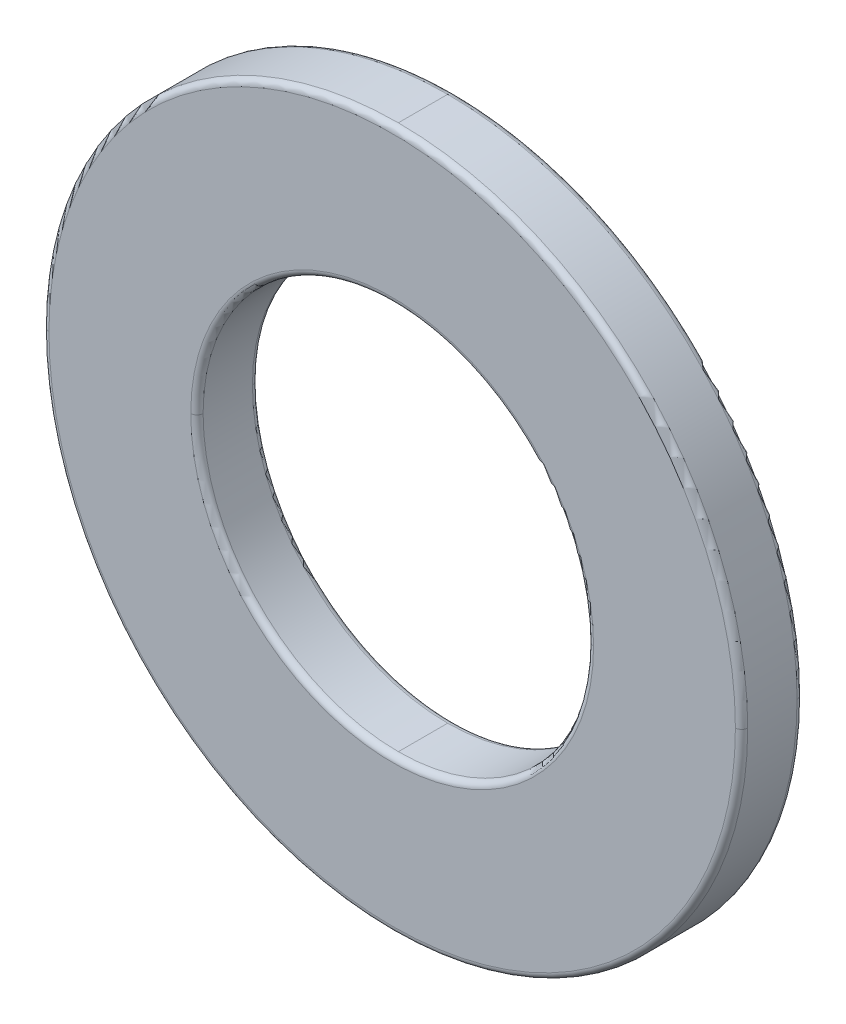
ISO-10303-21;
HEADER;
FILE_DESCRIPTION(('STEP AP214'),'2;1');
FILE_NAME('part.step','',(''),(''),'','','');
FILE_SCHEMA(('AUTOMOTIVE_DESIGN { 1 0 10303 214 1 1 1 1 }'));
ENDSEC;
DATA;
#1=APPLICATION_CONTEXT('core data for automotive mechanical design processes');
#2=APPLICATION_PROTOCOL_DEFINITION('international standard','automotive_design',2000,#1);
#3=PRODUCT_CONTEXT('',#1,'mechanical');
#4=PRODUCT('Part','Part','',(#3));
#5=PRODUCT_RELATED_PRODUCT_CATEGORY('part','',(#4));
#6=PRODUCT_DEFINITION_FORMATION('','',#4);
#7=PRODUCT_DEFINITION_CONTEXT('part definition',#1,'design');
#8=PRODUCT_DEFINITION('design','',#6,#7);
#9=PRODUCT_DEFINITION_SHAPE('','',#8);
#10=(LENGTH_UNIT() NAMED_UNIT(*) SI_UNIT(.MILLI.,.METRE.));
#11=(NAMED_UNIT(*) PLANE_ANGLE_UNIT() SI_UNIT($,.RADIAN.));
#12=(NAMED_UNIT(*) SI_UNIT($,.STERADIAN.) SOLID_ANGLE_UNIT());
#13=UNCERTAINTY_MEASURE_WITH_UNIT(LENGTH_MEASURE(1.E-05),#10,'distance_accuracy_value','');
#14=(GEOMETRIC_REPRESENTATION_CONTEXT(3) GLOBAL_UNCERTAINTY_ASSIGNED_CONTEXT((#13)) GLOBAL_UNIT_ASSIGNED_CONTEXT((#10,
#11,#12)) REPRESENTATION_CONTEXT('',''));
#15=CARTESIAN_POINT('',(0.,0.,0.));
#16=DIRECTION('',(0.,0.,1.));
#17=DIRECTION('',(1.,0.,0.));
#18=AXIS2_PLACEMENT_3D('',#15,#16,#17);
#19=CARTESIAN_POINT('',(0.,0.,128.2));
#20=DIRECTION('',(0.,0.,-1.));
#21=DIRECTION('',(-1.,0.,0.));
#22=AXIS2_PLACEMENT_3D('',#19,#20,#21);
#23=TOROIDAL_SURFACE('',#22,9.8,0.3);
#24=CARTESIAN_POINT('',(-9.8,0.,128.2));
#25=DIRECTION('',(0.,-1.,0.));
#26=DIRECTION('',(-1.,0.,0.));
#27=AXIS2_PLACEMENT_3D('',#24,#25,#26);
#28=CIRCLE('',#27,0.3);
#29=CARTESIAN_POINT('',(-9.5,0.,128.2));
#30=VERTEX_POINT('',#29);
#31=CARTESIAN_POINT('',(-9.8,0.,128.5));
#32=VERTEX_POINT('',#31);
#33=EDGE_CURVE('E11',#30,#32,#28,.T.);
#34=ORIENTED_EDGE('',*,*,#33,.T.);
#35=CARTESIAN_POINT('',(0.,0.,128.5));
#36=DIRECTION('',(0.,0.,1.));
#37=DIRECTION('',(0.,1.,0.));
#38=AXIS2_PLACEMENT_3D('',#35,#36,#37);
#39=CIRCLE('',#38,9.8);
#40=CARTESIAN_POINT('',(9.8,0.,128.5));
#41=VERTEX_POINT('',#40);
#42=EDGE_CURVE('E52',#32,#41,#39,.T.);
#43=ORIENTED_EDGE('',*,*,#42,.T.);
#44=CARTESIAN_POINT('',(9.8,0.,128.2));
#45=DIRECTION('',(0.,-1.,0.));
#46=DIRECTION('',(1.,0.,0.));
#47=AXIS2_PLACEMENT_3D('',#44,#45,#46);
#48=CIRCLE('',#47,0.3);
#49=CARTESIAN_POINT('',(9.5,0.,128.2));
#50=VERTEX_POINT('',#49);
#51=EDGE_CURVE('E207',#41,#50,#48,.T.);
#52=ORIENTED_EDGE('',*,*,#51,.T.);
#53=CARTESIAN_POINT('',(0.,0.,128.2));
#54=DIRECTION('',(0.,0.,-1.));
#55=DIRECTION('',(0.,1.,0.));
#56=AXIS2_PLACEMENT_3D('',#53,#54,#55);
#57=CIRCLE('',#56,9.5);
#58=CARTESIAN_POINT('',(0.,-9.5,128.2));
#59=VERTEX_POINT('',#58);
#60=EDGE_CURVE('E196',#50,#59,#57,.T.);
#61=ORIENTED_EDGE('',*,*,#60,.T.);
#62=CARTESIAN_POINT('',(0.,0.,128.2));
#63=DIRECTION('',(0.,0.,-1.));
#64=DIRECTION('',(0.,1.,0.));
#65=AXIS2_PLACEMENT_3D('',#62,#63,#64);
#66=CIRCLE('',#65,9.5);
#67=EDGE_CURVE('E144',#59,#30,#66,.T.);
#68=ORIENTED_EDGE('',*,*,#67,.T.);
#69=EDGE_LOOP('',(#34,#43,#52,#61,#68));
#70=FACE_BOUND('',#69,.T.);
#71=ADVANCED_FACE('F42',(#70),#23,.T.);
#72=CARTESIAN_POINT('',(0.,0.,125.5));
#73=DIRECTION('',(0.,0.,-1.));
#74=DIRECTION('',(0.,1.,0.));
#75=AXIS2_PLACEMENT_3D('',#72,#73,#74);
#76=CYLINDRICAL_SURFACE('',#75,9.5);
#77=DIRECTION('',(0.,0.,-1.));
#78=VECTOR('',#77,1.);
#79=CARTESIAN_POINT('',(0.,9.5,127.));
#80=LINE('',#79,#78);
#81=CARTESIAN_POINT('',(0.,9.5,128.2));
#82=VERTEX_POINT('',#81);
#83=CARTESIAN_POINT('',(0.,9.5,125.8));
#84=VERTEX_POINT('',#83);
#85=EDGE_CURVE('E163',#82,#84,#80,.T.);
#86=ORIENTED_EDGE('',*,*,#85,.T.);
#87=CARTESIAN_POINT('',(0.,0.,125.8));
#88=DIRECTION('',(0.,0.,1.));
#89=DIRECTION('',(0.,1.,0.));
#90=AXIS2_PLACEMENT_3D('',#87,#88,#89);
#91=CIRCLE('',#90,9.5);
#92=CARTESIAN_POINT('',(9.5,0.,125.8));
#93=VERTEX_POINT('',#92);
#94=EDGE_CURVE('E150',#93,#84,#91,.T.);
#95=ORIENTED_EDGE('',*,*,#94,.F.);
#96=CARTESIAN_POINT('',(0.,0.,125.8));
#97=DIRECTION('',(0.,0.,1.));
#98=DIRECTION('',(0.,1.,0.));
#99=AXIS2_PLACEMENT_3D('',#96,#97,#98);
#100=CIRCLE('',#99,9.5);
#101=CARTESIAN_POINT('',(0.,-9.5,125.8));
#102=VERTEX_POINT('',#101);
#103=EDGE_CURVE('E199',#102,#93,#100,.T.);
#104=ORIENTED_EDGE('',*,*,#103,.F.);
#105=DIRECTION('',(0.,0.,1.));
#106=VECTOR('',#105,1.);
#107=CARTESIAN_POINT('',(0.,-9.5,127.));
#108=LINE('',#107,#106);
#109=EDGE_CURVE('E170',#102,#59,#108,.T.);
#110=ORIENTED_EDGE('',*,*,#109,.T.);
#111=ORIENTED_EDGE('',*,*,#60,.F.);
#112=CARTESIAN_POINT('',(0.,0.,128.2));
#113=DIRECTION('',(0.,0.,-1.));
#114=DIRECTION('',(0.,1.,0.));
#115=AXIS2_PLACEMENT_3D('',#112,#113,#114);
#116=CIRCLE('',#115,9.5);
#117=EDGE_CURVE('E166',#82,#50,#116,.T.);
#118=ORIENTED_EDGE('',*,*,#117,.F.);
#119=EDGE_LOOP('',(#86,#95,#104,#110,#111,#118));
#120=FACE_BOUND('',#119,.T.);
#121=ADVANCED_FACE('F164',(#120),#76,.F.);
#122=CARTESIAN_POINT('',(0.,0.,125.8));
#123=DIRECTION('',(0.,0.,1.));
#124=DIRECTION('',(1.,0.,0.));
#125=AXIS2_PLACEMENT_3D('',#122,#123,#124);
#126=TOROIDAL_SURFACE('',#125,9.8,0.3);
#127=CARTESIAN_POINT('',(9.8,0.,125.8));
#128=DIRECTION('',(0.,-1.,0.));
#129=DIRECTION('',(1.,0.,0.));
#130=AXIS2_PLACEMENT_3D('',#127,#128,#129);
#131=CIRCLE('',#130,0.3);
#132=CARTESIAN_POINT('',(9.8,0.,125.5));
#133=VERTEX_POINT('',#132);
#134=EDGE_CURVE('E157',#93,#133,#131,.T.);
#135=ORIENTED_EDGE('',*,*,#134,.T.);
#136=CARTESIAN_POINT('',(0.,0.,125.5));
#137=DIRECTION('',(0.,0.,-1.));
#138=DIRECTION('',(0.,1.,0.));
#139=AXIS2_PLACEMENT_3D('',#136,#137,#138);
#140=CIRCLE('',#139,9.8);
#141=CARTESIAN_POINT('',(-9.8,0.,125.5));
#142=VERTEX_POINT('',#141);
#143=EDGE_CURVE('E211',#133,#142,#140,.T.);
#144=ORIENTED_EDGE('',*,*,#143,.T.);
#145=CARTESIAN_POINT('',(-9.8,0.,125.8));
#146=DIRECTION('',(0.,-1.,0.));
#147=DIRECTION('',(-1.,0.,0.));
#148=AXIS2_PLACEMENT_3D('',#145,#146,#147);
#149=CIRCLE('',#148,0.3);
#150=CARTESIAN_POINT('',(-9.5,0.,125.8));
#151=VERTEX_POINT('',#150);
#152=EDGE_CURVE('E213',#142,#151,#149,.T.);
#153=ORIENTED_EDGE('',*,*,#152,.T.);
#154=CARTESIAN_POINT('',(0.,0.,125.8));
#155=DIRECTION('',(0.,0.,1.));
#156=DIRECTION('',(0.,1.,0.));
#157=AXIS2_PLACEMENT_3D('',#154,#155,#156);
#158=CIRCLE('',#157,9.5);
#159=EDGE_CURVE('E175',#151,#102,#158,.T.);
#160=ORIENTED_EDGE('',*,*,#159,.T.);
#161=ORIENTED_EDGE('',*,*,#103,.T.);
#162=EDGE_LOOP('',(#135,#144,#153,#160,#161));
#163=FACE_BOUND('',#162,.T.);
#164=ADVANCED_FACE('F270',(#163),#126,.T.);
#165=CARTESIAN_POINT('',(0.,0.,125.8));
#166=DIRECTION('',(0.,0.,-1.));
#167=DIRECTION('',(-1.,0.,0.));
#168=AXIS2_PLACEMENT_3D('',#165,#166,#167);
#169=TOROIDAL_SURFACE('',#168,16.7,0.3);
#170=CARTESIAN_POINT('',(-16.7,0.,125.8));
#171=DIRECTION('',(0.,-1.,0.));
#172=DIRECTION('',(-1.,0.,0.));
#173=AXIS2_PLACEMENT_3D('',#170,#171,#172);
#174=CIRCLE('',#173,0.3);
#175=CARTESIAN_POINT('',(-17.,0.,125.8));
#176=VERTEX_POINT('',#175);
#177=CARTESIAN_POINT('',(-16.7,0.,125.5));
#178=VERTEX_POINT('',#177);
#179=EDGE_CURVE('E201',#176,#178,#174,.T.);
#180=ORIENTED_EDGE('',*,*,#179,.T.);
#181=CARTESIAN_POINT('',(0.,0.,125.5));
#182=DIRECTION('',(0.,0.,1.));
#183=DIRECTION('',(0.,1.,0.));
#184=AXIS2_PLACEMENT_3D('',#181,#182,#183);
#185=CIRCLE('',#184,16.7);
#186=CARTESIAN_POINT('',(16.7,0.,125.5));
#187=VERTEX_POINT('',#186);
#188=EDGE_CURVE('E240',#178,#187,#185,.T.);
#189=ORIENTED_EDGE('',*,*,#188,.T.);
#190=CARTESIAN_POINT('',(16.7,0.,125.8));
#191=DIRECTION('',(0.,-1.,0.));
#192=DIRECTION('',(1.,0.,0.));
#193=AXIS2_PLACEMENT_3D('',#190,#191,#192);
#194=CIRCLE('',#193,0.3);
#195=CARTESIAN_POINT('',(17.,0.,125.8));
#196=VERTEX_POINT('',#195);
#197=EDGE_CURVE('E95',#187,#196,#194,.T.);
#198=ORIENTED_EDGE('',*,*,#197,.T.);
#199=CARTESIAN_POINT('',(0.,0.,125.8));
#200=DIRECTION('',(0.,0.,-1.));
#201=DIRECTION('',(0.,1.,0.));
#202=AXIS2_PLACEMENT_3D('',#199,#200,#201);
#203=CIRCLE('',#202,17.);
#204=CARTESIAN_POINT('',(0.,-17.,125.8));
#205=VERTEX_POINT('',#204);
#206=EDGE_CURVE('E106',#196,#205,#203,.T.);
#207=ORIENTED_EDGE('',*,*,#206,.T.);
#208=CARTESIAN_POINT('',(0.,0.,125.8));
#209=DIRECTION('',(0.,0.,-1.));
#210=DIRECTION('',(0.,1.,0.));
#211=AXIS2_PLACEMENT_3D('',#208,#209,#210);
#212=CIRCLE('',#211,17.);
#213=EDGE_CURVE('E185',#205,#176,#212,.T.);
#214=ORIENTED_EDGE('',*,*,#213,.T.);
#215=EDGE_LOOP('',(#180,#189,#198,#207,#214));
#216=FACE_BOUND('',#215,.T.);
#217=ADVANCED_FACE('F256',(#216),#169,.T.);
#218=CARTESIAN_POINT('',(0.,0.,125.5));
#219=DIRECTION('',(0.,0.,-1.));
#220=DIRECTION('',(0.,1.,0.));
#221=AXIS2_PLACEMENT_3D('',#218,#219,#220);
#222=CYLINDRICAL_SURFACE('',#221,17.);
#223=DIRECTION('',(0.,0.,1.));
#224=VECTOR('',#223,1.);
#225=CARTESIAN_POINT('',(0.,17.,127.));
#226=LINE('',#225,#224);
#227=CARTESIAN_POINT('',(0.,17.,125.8));
#228=VERTEX_POINT('',#227);
#229=CARTESIAN_POINT('',(0.,17.,128.2));
#230=VERTEX_POINT('',#229);
#231=EDGE_CURVE('E183',#228,#230,#226,.T.);
#232=ORIENTED_EDGE('',*,*,#231,.T.);
#233=CARTESIAN_POINT('',(0.,0.,128.2));
#234=DIRECTION('',(0.,0.,1.));
#235=DIRECTION('',(0.,1.,0.));
#236=AXIS2_PLACEMENT_3D('',#233,#234,#235);
#237=CIRCLE('',#236,17.);
#238=CARTESIAN_POINT('',(17.,0.,128.2));
#239=VERTEX_POINT('',#238);
#240=EDGE_CURVE('E191',#239,#230,#237,.T.);
#241=ORIENTED_EDGE('',*,*,#240,.F.);
#242=CARTESIAN_POINT('',(0.,0.,128.2));
#243=DIRECTION('',(0.,0.,1.));
#244=DIRECTION('',(0.,1.,0.));
#245=AXIS2_PLACEMENT_3D('',#242,#243,#244);
#246=CIRCLE('',#245,17.);
#247=CARTESIAN_POINT('',(0.,-17.,128.2));
#248=VERTEX_POINT('',#247);
#249=EDGE_CURVE('E205',#248,#239,#246,.T.);
#250=ORIENTED_EDGE('',*,*,#249,.F.);
#251=DIRECTION('',(0.,0.,-1.));
#252=VECTOR('',#251,1.);
#253=CARTESIAN_POINT('',(0.,-17.,127.));
#254=LINE('',#253,#252);
#255=EDGE_CURVE('E186',#248,#205,#254,.T.);
#256=ORIENTED_EDGE('',*,*,#255,.T.);
#257=ORIENTED_EDGE('',*,*,#206,.F.);
#258=CARTESIAN_POINT('',(0.,0.,125.8));
#259=DIRECTION('',(0.,0.,-1.));
#260=DIRECTION('',(0.,1.,0.));
#261=AXIS2_PLACEMENT_3D('',#258,#259,#260);
#262=CIRCLE('',#261,17.);
#263=EDGE_CURVE('E197',#228,#196,#262,.T.);
#264=ORIENTED_EDGE('',*,*,#263,.F.);
#265=EDGE_LOOP('',(#232,#241,#250,#256,#257,#264));
#266=FACE_BOUND('',#265,.T.);
#267=ADVANCED_FACE('F224',(#266),#222,.T.);
#268=CARTESIAN_POINT('',(0.,0.,128.2));
#269=DIRECTION('',(0.,0.,-1.));
#270=DIRECTION('',(-1.,0.,0.));
#271=AXIS2_PLACEMENT_3D('',#268,#269,#270);
#272=TOROIDAL_SURFACE('',#271,16.7,0.3);
#273=CARTESIAN_POINT('',(-16.7,0.,128.2));
#274=DIRECTION('',(0.,-1.,0.));
#275=DIRECTION('',(-1.,0.,0.));
#276=AXIS2_PLACEMENT_3D('',#273,#274,#275);
#277=CIRCLE('',#276,0.3);
#278=CARTESIAN_POINT('',(-16.7,0.,128.5));
#279=VERTEX_POINT('',#278);
#280=CARTESIAN_POINT('',(-17.,0.,128.2));
#281=VERTEX_POINT('',#280);
#282=EDGE_CURVE('E46',#279,#281,#277,.T.);
#283=ORIENTED_EDGE('',*,*,#282,.T.);
#284=CARTESIAN_POINT('',(0.,0.,128.2));
#285=DIRECTION('',(0.,0.,1.));
#286=DIRECTION('',(0.,1.,0.));
#287=AXIS2_PLACEMENT_3D('',#284,#285,#286);
#288=CIRCLE('',#287,17.);
#289=EDGE_CURVE('E202',#281,#248,#288,.T.);
#290=ORIENTED_EDGE('',*,*,#289,.T.);
#291=ORIENTED_EDGE('',*,*,#249,.T.);
#292=CARTESIAN_POINT('',(16.7,0.,128.2));
#293=DIRECTION('',(0.,-1.,0.));
#294=DIRECTION('',(1.,0.,0.));
#295=AXIS2_PLACEMENT_3D('',#292,#293,#294);
#296=CIRCLE('',#295,0.3);
#297=CARTESIAN_POINT('',(16.7,0.,128.5));
#298=VERTEX_POINT('',#297);
#299=EDGE_CURVE('E232',#239,#298,#296,.T.);
#300=ORIENTED_EDGE('',*,*,#299,.T.);
#301=CARTESIAN_POINT('',(0.,0.,128.5));
#302=DIRECTION('',(0.,0.,-1.));
#303=DIRECTION('',(0.,1.,0.));
#304=AXIS2_PLACEMENT_3D('',#301,#302,#303);
#305=CIRCLE('',#304,16.7);
#306=CARTESIAN_POINT('',(0.,-16.7,128.5));
#307=VERTEX_POINT('',#306);
#308=EDGE_CURVE('E126',#298,#307,#305,.T.);
#309=ORIENTED_EDGE('',*,*,#308,.T.);
#310=CARTESIAN_POINT('',(0.,0.,128.5));
#311=DIRECTION('',(0.,0.,-1.));
#312=DIRECTION('',(0.,1.,0.));
#313=AXIS2_PLACEMENT_3D('',#310,#311,#312);
#314=CIRCLE('',#313,16.7);
#315=EDGE_CURVE('E123',#307,#279,#314,.T.);
#316=ORIENTED_EDGE('',*,*,#315,.T.);
#317=EDGE_LOOP('',(#283,#290,#291,#300,#309,#316));
#318=FACE_BOUND('',#317,.T.);
#319=ADVANCED_FACE('F257',(#318),#272,.T.);
#320=CARTESIAN_POINT('',(0.,0.,128.2));
#321=DIRECTION('',(0.,0.,-1.));
#322=DIRECTION('',(-1.,0.,0.));
#323=AXIS2_PLACEMENT_3D('',#320,#321,#322);
#324=TOROIDAL_SURFACE('',#323,16.7,0.3);
#325=ORIENTED_EDGE('',*,*,#282,.F.);
#326=CARTESIAN_POINT('',(0.,0.,128.5));
#327=DIRECTION('',(0.,0.,-1.));
#328=DIRECTION('',(0.,1.,0.));
#329=AXIS2_PLACEMENT_3D('',#326,#327,#328);
#330=CIRCLE('',#329,16.7);
#331=EDGE_CURVE('E233',#279,#298,#330,.T.);
#332=ORIENTED_EDGE('',*,*,#331,.T.);
#333=ORIENTED_EDGE('',*,*,#299,.F.);
#334=ORIENTED_EDGE('',*,*,#240,.T.);
#335=CARTESIAN_POINT('',(0.,0.,128.2));
#336=DIRECTION('',(0.,0.,1.));
#337=DIRECTION('',(0.,1.,0.));
#338=AXIS2_PLACEMENT_3D('',#335,#336,#337);
#339=CIRCLE('',#338,17.);
#340=EDGE_CURVE('E188',#230,#281,#339,.T.);
#341=ORIENTED_EDGE('',*,*,#340,.T.);
#342=EDGE_LOOP('',(#325,#332,#333,#334,#341));
#343=FACE_BOUND('',#342,.T.);
#344=ADVANCED_FACE('F230',(#343),#324,.T.);
#345=CARTESIAN_POINT('',(0.,0.,125.5));
#346=DIRECTION('',(0.,0.,-1.));
#347=DIRECTION('',(0.,1.,0.));
#348=AXIS2_PLACEMENT_3D('',#345,#346,#347);
#349=CYLINDRICAL_SURFACE('',#348,17.);
#350=ORIENTED_EDGE('',*,*,#231,.F.);
#351=CARTESIAN_POINT('',(0.,0.,125.8));
#352=DIRECTION('',(0.,0.,-1.));
#353=DIRECTION('',(0.,1.,0.));
#354=AXIS2_PLACEMENT_3D('',#351,#352,#353);
#355=CIRCLE('',#354,17.);
#356=EDGE_CURVE('E192',#176,#228,#355,.T.);
#357=ORIENTED_EDGE('',*,*,#356,.F.);
#358=ORIENTED_EDGE('',*,*,#213,.F.);
#359=ORIENTED_EDGE('',*,*,#255,.F.);
#360=ORIENTED_EDGE('',*,*,#289,.F.);
#361=ORIENTED_EDGE('',*,*,#340,.F.);
#362=EDGE_LOOP('',(#350,#357,#358,#359,#360,#361));
#363=FACE_BOUND('',#362,.T.);
#364=ADVANCED_FACE('F221',(#363),#349,.T.);
#365=CARTESIAN_POINT('',(0.,0.,128.5));
#366=DIRECTION('',(0.,0.,-1.));
#367=DIRECTION('',(-1.,0.,0.));
#368=AXIS2_PLACEMENT_3D('',#365,#366,#367);
#369=PLANE('',#368);
#370=ORIENTED_EDGE('',*,*,#315,.F.);
#371=ORIENTED_EDGE('',*,*,#308,.F.);
#372=ORIENTED_EDGE('',*,*,#331,.F.);
#373=EDGE_LOOP('',(#370,#371,#372));
#374=FACE_BOUND('',#373,.T.);
#375=CARTESIAN_POINT('',(0.,0.,128.5));
#376=DIRECTION('',(0.,0.,1.));
#377=DIRECTION('',(0.,1.,0.));
#378=AXIS2_PLACEMENT_3D('',#375,#376,#377);
#379=CIRCLE('',#378,9.8);
#380=EDGE_CURVE('E238',#41,#32,#379,.T.);
#381=ORIENTED_EDGE('',*,*,#380,.F.);
#382=ORIENTED_EDGE('',*,*,#42,.F.);
#383=EDGE_LOOP('',(#381,#382));
#384=FACE_BOUND('',#383,.T.);
#385=ADVANCED_FACE('F260',(#374,#384),#369,.F.);
#386=CARTESIAN_POINT('',(0.,0.,125.8));
#387=DIRECTION('',(0.,0.,-1.));
#388=DIRECTION('',(-1.,0.,0.));
#389=AXIS2_PLACEMENT_3D('',#386,#387,#388);
#390=TOROIDAL_SURFACE('',#389,16.7,0.3);
#391=ORIENTED_EDGE('',*,*,#179,.F.);
#392=ORIENTED_EDGE('',*,*,#356,.T.);
#393=ORIENTED_EDGE('',*,*,#263,.T.);
#394=ORIENTED_EDGE('',*,*,#197,.F.);
#395=CARTESIAN_POINT('',(0.,0.,125.5));
#396=DIRECTION('',(0.,0.,1.));
#397=DIRECTION('',(0.,1.,0.));
#398=AXIS2_PLACEMENT_3D('',#395,#396,#397);
#399=CIRCLE('',#398,16.7);
#400=EDGE_CURVE('E160',#187,#178,#399,.T.);
#401=ORIENTED_EDGE('',*,*,#400,.T.);
#402=EDGE_LOOP('',(#391,#392,#393,#394,#401));
#403=FACE_BOUND('',#402,.T.);
#404=ADVANCED_FACE('F217',(#403),#390,.T.);
#405=CARTESIAN_POINT('',(0.,0.,125.5));
#406=DIRECTION('',(0.,0.,-1.));
#407=DIRECTION('',(-1.,0.,0.));
#408=AXIS2_PLACEMENT_3D('',#405,#406,#407);
#409=PLANE('',#408);
#410=ORIENTED_EDGE('',*,*,#400,.F.);
#411=ORIENTED_EDGE('',*,*,#188,.F.);
#412=EDGE_LOOP('',(#410,#411));
#413=FACE_BOUND('',#412,.T.);
#414=CARTESIAN_POINT('',(0.,0.,125.5));
#415=DIRECTION('',(0.,0.,-1.));
#416=DIRECTION('',(0.,1.,0.));
#417=AXIS2_PLACEMENT_3D('',#414,#415,#416);
#418=CIRCLE('',#417,9.8);
#419=EDGE_CURVE('E177',#142,#133,#418,.T.);
#420=ORIENTED_EDGE('',*,*,#419,.F.);
#421=ORIENTED_EDGE('',*,*,#143,.F.);
#422=EDGE_LOOP('',(#420,#421));
#423=FACE_BOUND('',#422,.T.);
#424=ADVANCED_FACE('F44',(#413,#423),#409,.T.);
#425=CARTESIAN_POINT('',(0.,0.,125.8));
#426=DIRECTION('',(0.,0.,1.));
#427=DIRECTION('',(1.,0.,0.));
#428=AXIS2_PLACEMENT_3D('',#425,#426,#427);
#429=TOROIDAL_SURFACE('',#428,9.8,0.3);
#430=ORIENTED_EDGE('',*,*,#134,.F.);
#431=ORIENTED_EDGE('',*,*,#94,.T.);
#432=CARTESIAN_POINT('',(0.,0.,125.8));
#433=DIRECTION('',(0.,0.,1.));
#434=DIRECTION('',(0.,1.,0.));
#435=AXIS2_PLACEMENT_3D('',#432,#433,#434);
#436=CIRCLE('',#435,9.5);
#437=EDGE_CURVE('E154',#84,#151,#436,.T.);
#438=ORIENTED_EDGE('',*,*,#437,.T.);
#439=ORIENTED_EDGE('',*,*,#152,.F.);
#440=ORIENTED_EDGE('',*,*,#419,.T.);
#441=EDGE_LOOP('',(#430,#431,#438,#439,#440));
#442=FACE_BOUND('',#441,.T.);
#443=ADVANCED_FACE('F152',(#442),#429,.T.);
#444=CARTESIAN_POINT('',(0.,0.,125.5));
#445=DIRECTION('',(0.,0.,-1.));
#446=DIRECTION('',(0.,1.,0.));
#447=AXIS2_PLACEMENT_3D('',#444,#445,#446);
#448=CYLINDRICAL_SURFACE('',#447,9.5);
#449=ORIENTED_EDGE('',*,*,#85,.F.);
#450=CARTESIAN_POINT('',(0.,0.,128.2));
#451=DIRECTION('',(0.,0.,-1.));
#452=DIRECTION('',(0.,1.,0.));
#453=AXIS2_PLACEMENT_3D('',#450,#451,#452);
#454=CIRCLE('',#453,9.5);
#455=EDGE_CURVE('E179',#30,#82,#454,.T.);
#456=ORIENTED_EDGE('',*,*,#455,.F.);
#457=ORIENTED_EDGE('',*,*,#67,.F.);
#458=ORIENTED_EDGE('',*,*,#109,.F.);
#459=ORIENTED_EDGE('',*,*,#159,.F.);
#460=ORIENTED_EDGE('',*,*,#437,.F.);
#461=EDGE_LOOP('',(#449,#456,#457,#458,#459,#460));
#462=FACE_BOUND('',#461,.T.);
#463=ADVANCED_FACE('F172',(#462),#448,.F.);
#464=CARTESIAN_POINT('',(0.,0.,128.2));
#465=DIRECTION('',(0.,0.,-1.));
#466=DIRECTION('',(-1.,0.,0.));
#467=AXIS2_PLACEMENT_3D('',#464,#465,#466);
#468=TOROIDAL_SURFACE('',#467,9.8,0.3);
#469=ORIENTED_EDGE('',*,*,#33,.F.);
#470=ORIENTED_EDGE('',*,*,#455,.T.);
#471=ORIENTED_EDGE('',*,*,#117,.T.);
#472=ORIENTED_EDGE('',*,*,#51,.F.);
#473=ORIENTED_EDGE('',*,*,#380,.T.);
#474=EDGE_LOOP('',(#469,#470,#471,#472,#473));
#475=FACE_BOUND('',#474,.T.);
#476=ADVANCED_FACE('F264',(#475),#468,.T.);
#477=CLOSED_SHELL('',(#71,#121,#164,#217,#267,#319,#344,#364,#385,#404,#424,#443,#463,#476));
#478=MANIFOLD_SOLID_BREP('B2',#477);
#479=ADVANCED_BREP_SHAPE_REPRESENTATION('',(#18,#478),#14);
#480=SHAPE_DEFINITION_REPRESENTATION(#9,#479);
ENDSEC;
END-ISO-10303-21;
